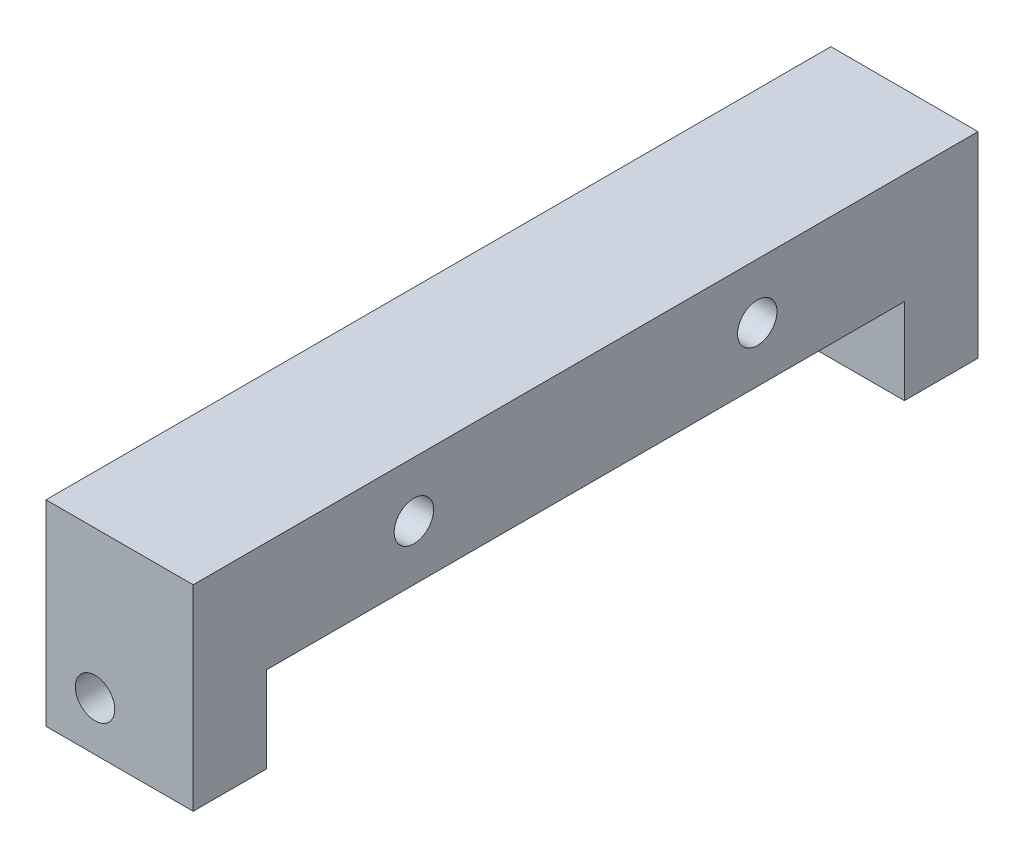
ISO-10303-21;
HEADER;
FILE_DESCRIPTION(('STEP AP214'),'2;1');
FILE_NAME('part.step','',(''),(''),'','','');
FILE_SCHEMA(('AUTOMOTIVE_DESIGN { 1 0 10303 214 1 1 1 1 }'));
ENDSEC;
DATA;
#1=APPLICATION_CONTEXT('core data for automotive mechanical design processes');
#2=APPLICATION_PROTOCOL_DEFINITION('international standard','automotive_design',2000,#1);
#3=PRODUCT_CONTEXT('',#1,'mechanical');
#4=PRODUCT('Part','Part','',(#3));
#5=PRODUCT_RELATED_PRODUCT_CATEGORY('part','',(#4));
#6=PRODUCT_DEFINITION_FORMATION('','',#4);
#7=PRODUCT_DEFINITION_CONTEXT('part definition',#1,'design');
#8=PRODUCT_DEFINITION('design','',#6,#7);
#9=PRODUCT_DEFINITION_SHAPE('','',#8);
#10=(LENGTH_UNIT() NAMED_UNIT(*) SI_UNIT(.MILLI.,.METRE.));
#11=(NAMED_UNIT(*) PLANE_ANGLE_UNIT() SI_UNIT($,.RADIAN.));
#12=(NAMED_UNIT(*) SI_UNIT($,.STERADIAN.) SOLID_ANGLE_UNIT());
#13=UNCERTAINTY_MEASURE_WITH_UNIT(LENGTH_MEASURE(1.E-05),#10,'distance_accuracy_value','');
#14=(GEOMETRIC_REPRESENTATION_CONTEXT(3) GLOBAL_UNCERTAINTY_ASSIGNED_CONTEXT((#13)) GLOBAL_UNIT_ASSIGNED_CONTEXT((#10,
#11,#12)) REPRESENTATION_CONTEXT('',''));
#15=CARTESIAN_POINT('',(0.,0.,0.));
#16=DIRECTION('',(0.,0.,1.));
#17=DIRECTION('',(1.,0.,0.));
#18=AXIS2_PLACEMENT_3D('',#15,#16,#17);
#19=CARTESIAN_POINT('',(-9.525,-12.7,50.8));
#20=DIRECTION('',(0.,1.,0.));
#21=DIRECTION('',(0.,0.,1.));
#22=AXIS2_PLACEMENT_3D('',#19,#20,#21);
#23=PLANE('',#22);
#24=CARTESIAN_POINT('',(4.7625,-12.7,46.0375));
#25=DIRECTION('',(0.,-1.,0.));
#26=DIRECTION('',(0.,0.,-1.));
#27=AXIS2_PLACEMENT_3D('',#24,#25,#26);
#28=CIRCLE('',#27,2.55269999999999);
#29=CARTESIAN_POINT('',(4.7625,-12.7,43.4848));
#30=VERTEX_POINT('',#29);
#31=EDGE_CURVE('E125',#30,#30,#28,.T.);
#32=ORIENTED_EDGE('',*,*,#31,.F.);
#33=EDGE_LOOP('',(#32));
#34=FACE_BOUND('',#33,.T.);
#35=DIRECTION('',(0.,0.,-1.));
#36=VECTOR('',#35,1.);
#37=CARTESIAN_POINT('',(-9.525,-12.7,50.8));
#38=LINE('',#37,#36);
#39=CARTESIAN_POINT('',(-9.525,-12.7,50.8));
#40=VERTEX_POINT('',#39);
#41=CARTESIAN_POINT('',(-9.525,-12.7,41.275));
#42=VERTEX_POINT('',#41);
#43=EDGE_CURVE('E11',#40,#42,#38,.T.);
#44=ORIENTED_EDGE('',*,*,#43,.T.);
#45=DIRECTION('',(1.,0.,0.));
#46=VECTOR('',#45,1.);
#47=CARTESIAN_POINT('',(-9.52600000000001,-12.7,41.275));
#48=LINE('',#47,#46);
#49=CARTESIAN_POINT('',(9.525,-12.7,41.275));
#50=VERTEX_POINT('',#49);
#51=EDGE_CURVE('E168',#42,#50,#48,.T.);
#52=ORIENTED_EDGE('',*,*,#51,.T.);
#53=DIRECTION('',(0.,0.,-1.));
#54=VECTOR('',#53,1.);
#55=CARTESIAN_POINT('',(9.525,-12.7,50.8));
#56=LINE('',#55,#54);
#57=CARTESIAN_POINT('',(9.525,-12.7,50.8));
#58=VERTEX_POINT('',#57);
#59=EDGE_CURVE('E195',#58,#50,#56,.T.);
#60=ORIENTED_EDGE('',*,*,#59,.F.);
#61=DIRECTION('',(1.,0.,0.));
#62=VECTOR('',#61,1.);
#63=CARTESIAN_POINT('',(-9.525,-12.7,50.8));
#64=LINE('',#63,#62);
#65=EDGE_CURVE('E88',#40,#58,#64,.T.);
#66=ORIENTED_EDGE('',*,*,#65,.F.);
#67=EDGE_LOOP('',(#44,#52,#60,#66));
#68=FACE_BOUND('',#67,.T.);
#69=ADVANCED_FACE('F36',(#34,#68),#23,.F.);
#70=CARTESIAN_POINT('',(-9.525,12.7,50.8));
#71=DIRECTION('',(1.,0.,0.));
#72=DIRECTION('',(0.,1.,0.));
#73=AXIS2_PLACEMENT_3D('',#70,#71,#72);
#74=PLANE('',#73);
#75=CARTESIAN_POINT('',(-9.525,5.56260000000001,-22.225));
#76=DIRECTION('',(-1.,0.,0.));
#77=DIRECTION('',(0.,0.,1.));
#78=AXIS2_PLACEMENT_3D('',#75,#76,#77);
#79=CIRCLE('',#78,2.55269999999999);
#80=CARTESIAN_POINT('',(-9.525,5.56260000000001,-19.6723));
#81=VERTEX_POINT('',#80);
#82=EDGE_CURVE('E285',#81,#81,#79,.T.);
#83=ORIENTED_EDGE('',*,*,#82,.F.);
#84=EDGE_LOOP('',(#83));
#85=FACE_BOUND('',#84,.T.);
#86=CARTESIAN_POINT('',(-9.525,5.5626,22.225));
#87=DIRECTION('',(-1.,0.,0.));
#88=DIRECTION('',(0.,0.,1.));
#89=AXIS2_PLACEMENT_3D('',#86,#87,#88);
#90=CIRCLE('',#89,2.55269999999999);
#91=CARTESIAN_POINT('',(-9.525,5.5626,24.7777));
#92=VERTEX_POINT('',#91);
#93=EDGE_CURVE('E132',#92,#92,#90,.T.);
#94=ORIENTED_EDGE('',*,*,#93,.F.);
#95=EDGE_LOOP('',(#94));
#96=FACE_BOUND('',#95,.T.);
#97=DIRECTION('',(0.,0.,-1.));
#98=VECTOR('',#97,1.);
#99=CARTESIAN_POINT('',(-9.525,-1.5875,41.275));
#100=LINE('',#99,#98);
#101=CARTESIAN_POINT('',(-9.525,-1.5875,41.275));
#102=VERTEX_POINT('',#101);
#103=CARTESIAN_POINT('',(-9.525,-1.5875,-41.275));
#104=VERTEX_POINT('',#103);
#105=EDGE_CURVE('E155',#102,#104,#100,.T.);
#106=ORIENTED_EDGE('',*,*,#105,.F.);
#107=DIRECTION('',(0.,1.,0.));
#108=VECTOR('',#107,1.);
#109=CARTESIAN_POINT('',(-9.525,-12.7,41.275));
#110=LINE('',#109,#108);
#111=EDGE_CURVE('E158',#42,#102,#110,.T.);
#112=ORIENTED_EDGE('',*,*,#111,.F.);
#113=ORIENTED_EDGE('',*,*,#43,.F.);
#114=DIRECTION('',(0.,-1.,0.));
#115=VECTOR('',#114,1.);
#116=CARTESIAN_POINT('',(-9.525,12.7,50.8));
#117=LINE('',#116,#115);
#118=CARTESIAN_POINT('',(-9.525,12.7,50.8));
#119=VERTEX_POINT('',#118);
#120=EDGE_CURVE('E177',#119,#40,#117,.T.);
#121=ORIENTED_EDGE('',*,*,#120,.F.);
#122=DIRECTION('',(0.,0.,-1.));
#123=VECTOR('',#122,1.);
#124=CARTESIAN_POINT('',(-9.525,12.7,50.8));
#125=LINE('',#124,#123);
#126=CARTESIAN_POINT('',(-9.525,12.7,-50.8));
#127=VERTEX_POINT('',#126);
#128=EDGE_CURVE('E183',#119,#127,#125,.T.);
#129=ORIENTED_EDGE('',*,*,#128,.T.);
#130=DIRECTION('',(0.,-1.,0.));
#131=VECTOR('',#130,1.);
#132=CARTESIAN_POINT('',(-9.525,12.7,-50.8));
#133=LINE('',#132,#131);
#134=CARTESIAN_POINT('',(-9.525,-12.7,-50.8));
#135=VERTEX_POINT('',#134);
#136=EDGE_CURVE('E171',#127,#135,#133,.T.);
#137=ORIENTED_EDGE('',*,*,#136,.T.);
#138=CARTESIAN_POINT('',(-9.525,-12.7,-41.275));
#139=VERTEX_POINT('',#138);
#140=EDGE_CURVE('E44',#139,#135,#38,.T.);
#141=ORIENTED_EDGE('',*,*,#140,.F.);
#142=DIRECTION('',(0.,-1.,0.));
#143=VECTOR('',#142,1.);
#144=CARTESIAN_POINT('',(-9.525,-12.7,-41.275));
#145=LINE('',#144,#143);
#146=EDGE_CURVE('E153',#104,#139,#145,.T.);
#147=ORIENTED_EDGE('',*,*,#146,.F.);
#148=EDGE_LOOP('',(#106,#112,#113,#121,#129,#137,#141,#147));
#149=FACE_BOUND('',#148,.T.);
#150=ADVANCED_FACE('F38',(#85,#96,#149),#74,.F.);
#151=CARTESIAN_POINT('',(4.7625,-12.7,-46.0375));
#152=DIRECTION('',(0.,-1.,0.));
#153=DIRECTION('',(0.,0.,-1.));
#154=AXIS2_PLACEMENT_3D('',#151,#152,#153);
#155=CIRCLE('',#154,2.55269999999999);
#156=CARTESIAN_POINT('',(4.7625,-12.7,-48.5902));
#157=VERTEX_POINT('',#156);
#158=EDGE_CURVE('E138',#157,#157,#155,.T.);
#159=ORIENTED_EDGE('',*,*,#158,.F.);
#160=EDGE_LOOP('',(#159));
#161=FACE_BOUND('',#160,.T.);
#162=CARTESIAN_POINT('',(9.525,-12.7,-41.275));
#163=VERTEX_POINT('',#162);
#164=CARTESIAN_POINT('',(9.525,-12.7,-50.8));
#165=VERTEX_POINT('',#164);
#166=EDGE_CURVE('E194',#163,#165,#56,.T.);
#167=ORIENTED_EDGE('',*,*,#166,.F.);
#168=DIRECTION('',(1.,0.,0.));
#169=VECTOR('',#168,1.);
#170=CARTESIAN_POINT('',(-9.52600000000001,-12.7,-41.275));
#171=LINE('',#170,#169);
#172=EDGE_CURVE('E51',#139,#163,#171,.T.);
#173=ORIENTED_EDGE('',*,*,#172,.F.);
#174=ORIENTED_EDGE('',*,*,#140,.T.);
#175=DIRECTION('',(1.,0.,0.));
#176=VECTOR('',#175,1.);
#177=CARTESIAN_POINT('',(-9.525,-12.7,-50.8));
#178=LINE('',#177,#176);
#179=EDGE_CURVE('E186',#135,#165,#178,.T.);
#180=ORIENTED_EDGE('',*,*,#179,.T.);
#181=EDGE_LOOP('',(#167,#173,#174,#180));
#182=FACE_BOUND('',#181,.T.);
#183=ADVANCED_FACE('F207',(#161,#182),#23,.F.);
#184=CARTESIAN_POINT('',(9.525,12.7,50.8));
#185=DIRECTION('',(-1.,0.,0.));
#186=DIRECTION('',(0.,-1.,0.));
#187=AXIS2_PLACEMENT_3D('',#184,#185,#186);
#188=PLANE('',#187);
#189=CARTESIAN_POINT('',(9.525,5.56260000000001,-22.225));
#190=DIRECTION('',(-1.,0.,0.));
#191=DIRECTION('',(0.,-1.,0.));
#192=AXIS2_PLACEMENT_3D('',#189,#190,#191);
#193=CIRCLE('',#192,2.55269999999999);
#194=CARTESIAN_POINT('',(9.525,3.00990000000002,-22.225));
#195=VERTEX_POINT('',#194);
#196=EDGE_CURVE('E282',#195,#195,#193,.T.);
#197=ORIENTED_EDGE('',*,*,#196,.T.);
#198=EDGE_LOOP('',(#197));
#199=FACE_BOUND('',#198,.T.);
#200=CARTESIAN_POINT('',(9.525,5.5626,22.225));
#201=DIRECTION('',(-1.,0.,0.));
#202=DIRECTION('',(0.,-1.,0.));
#203=AXIS2_PLACEMENT_3D('',#200,#201,#202);
#204=CIRCLE('',#203,2.55269999999999);
#205=CARTESIAN_POINT('',(9.525,3.00990000000001,22.225));
#206=VERTEX_POINT('',#205);
#207=EDGE_CURVE('E126',#206,#206,#204,.T.);
#208=ORIENTED_EDGE('',*,*,#207,.T.);
#209=EDGE_LOOP('',(#208));
#210=FACE_BOUND('',#209,.T.);
#211=ORIENTED_EDGE('',*,*,#59,.T.);
#212=DIRECTION('',(0.,-1.,0.));
#213=VECTOR('',#212,1.);
#214=CARTESIAN_POINT('',(9.525,-12.7,41.275));
#215=LINE('',#214,#213);
#216=CARTESIAN_POINT('',(9.525,-1.5875,41.275));
#217=VERTEX_POINT('',#216);
#218=EDGE_CURVE('E161',#217,#50,#215,.T.);
#219=ORIENTED_EDGE('',*,*,#218,.F.);
#220=DIRECTION('',(0.,0.,1.));
#221=VECTOR('',#220,1.);
#222=CARTESIAN_POINT('',(9.525,-1.5875,41.275));
#223=LINE('',#222,#221);
#224=CARTESIAN_POINT('',(9.525,-1.5875,-41.275));
#225=VERTEX_POINT('',#224);
#226=EDGE_CURVE('E165',#225,#217,#223,.T.);
#227=ORIENTED_EDGE('',*,*,#226,.F.);
#228=DIRECTION('',(0.,1.,0.));
#229=VECTOR('',#228,1.);
#230=CARTESIAN_POINT('',(9.525,-12.7,-41.275));
#231=LINE('',#230,#229);
#232=EDGE_CURVE('E163',#163,#225,#231,.T.);
#233=ORIENTED_EDGE('',*,*,#232,.F.);
#234=ORIENTED_EDGE('',*,*,#166,.T.);
#235=DIRECTION('',(0.,1.,0.));
#236=VECTOR('',#235,1.);
#237=CARTESIAN_POINT('',(9.525,12.7,-50.8));
#238=LINE('',#237,#236);
#239=CARTESIAN_POINT('',(9.525,12.7,-50.8));
#240=VERTEX_POINT('',#239);
#241=EDGE_CURVE('E189',#165,#240,#238,.T.);
#242=ORIENTED_EDGE('',*,*,#241,.T.);
#243=DIRECTION('',(0.,0.,-1.));
#244=VECTOR('',#243,1.);
#245=CARTESIAN_POINT('',(9.525,12.7,50.8));
#246=LINE('',#245,#244);
#247=CARTESIAN_POINT('',(9.525,12.7,50.8));
#248=VERTEX_POINT('',#247);
#249=EDGE_CURVE('E193',#248,#240,#246,.T.);
#250=ORIENTED_EDGE('',*,*,#249,.F.);
#251=DIRECTION('',(0.,1.,0.));
#252=VECTOR('',#251,1.);
#253=CARTESIAN_POINT('',(9.525,12.7,50.8));
#254=LINE('',#253,#252);
#255=EDGE_CURVE('E180',#58,#248,#254,.T.);
#256=ORIENTED_EDGE('',*,*,#255,.F.);
#257=EDGE_LOOP('',(#211,#219,#227,#233,#234,#242,#250,#256));
#258=FACE_BOUND('',#257,.T.);
#259=ADVANCED_FACE('F201',(#199,#210,#258),#188,.F.);
#260=CARTESIAN_POINT('',(-9.525,12.7,50.8));
#261=DIRECTION('',(0.,-1.,0.));
#262=DIRECTION('',(0.,0.,-1.));
#263=AXIS2_PLACEMENT_3D('',#260,#261,#262);
#264=PLANE('',#263);
#265=DIRECTION('',(-1.,0.,0.));
#266=VECTOR('',#265,1.);
#267=CARTESIAN_POINT('',(-9.525,12.7,-50.8));
#268=LINE('',#267,#266);
#269=EDGE_CURVE('E81',#240,#127,#268,.T.);
#270=ORIENTED_EDGE('',*,*,#269,.T.);
#271=ORIENTED_EDGE('',*,*,#128,.F.);
#272=DIRECTION('',(-1.,0.,0.));
#273=VECTOR('',#272,1.);
#274=CARTESIAN_POINT('',(-9.525,12.7,50.8));
#275=LINE('',#274,#273);
#276=EDGE_CURVE('E60',#248,#119,#275,.T.);
#277=ORIENTED_EDGE('',*,*,#276,.F.);
#278=ORIENTED_EDGE('',*,*,#249,.T.);
#279=EDGE_LOOP('',(#270,#271,#277,#278));
#280=FACE_BOUND('',#279,.T.);
#281=ADVANCED_FACE('F217',(#280),#264,.F.);
#282=CARTESIAN_POINT('',(-9.525,-12.7,50.8));
#283=DIRECTION('',(0.,0.,1.));
#284=DIRECTION('',(1.,0.,0.));
#285=AXIS2_PLACEMENT_3D('',#282,#283,#284);
#286=PLANE('',#285);
#287=CARTESIAN_POINT('',(-3.175,-6.35,50.8));
#288=DIRECTION('',(0.,0.,1.));
#289=DIRECTION('',(1.,0.,0.));
#290=AXIS2_PLACEMENT_3D('',#287,#288,#289);
#291=CIRCLE('',#290,2.55269999999999);
#292=CARTESIAN_POINT('',(-0.622300000000017,-6.35,50.8));
#293=VERTEX_POINT('',#292);
#294=EDGE_CURVE('E141',#293,#293,#291,.T.);
#295=ORIENTED_EDGE('',*,*,#294,.F.);
#296=EDGE_LOOP('',(#295));
#297=FACE_BOUND('',#296,.T.);
#298=ORIENTED_EDGE('',*,*,#120,.T.);
#299=ORIENTED_EDGE('',*,*,#65,.T.);
#300=ORIENTED_EDGE('',*,*,#255,.T.);
#301=ORIENTED_EDGE('',*,*,#276,.T.);
#302=EDGE_LOOP('',(#298,#299,#300,#301));
#303=FACE_BOUND('',#302,.T.);
#304=ADVANCED_FACE('F218',(#297,#303),#286,.T.);
#305=CARTESIAN_POINT('',(-9.525,-12.7,-50.8));
#306=DIRECTION('',(0.,0.,1.));
#307=DIRECTION('',(1.,0.,0.));
#308=AXIS2_PLACEMENT_3D('',#305,#306,#307);
#309=PLANE('',#308);
#310=CARTESIAN_POINT('',(-3.175,-6.35,-50.8));
#311=DIRECTION('',(0.,0.,-1.));
#312=DIRECTION('',(-1.,0.,0.));
#313=AXIS2_PLACEMENT_3D('',#310,#311,#312);
#314=CIRCLE('',#313,2.55269999999999);
#315=CARTESIAN_POINT('',(-5.72769999999999,-6.35,-50.8));
#316=VERTEX_POINT('',#315);
#317=EDGE_CURVE('E147',#316,#316,#314,.T.);
#318=ORIENTED_EDGE('',*,*,#317,.F.);
#319=EDGE_LOOP('',(#318));
#320=FACE_BOUND('',#319,.T.);
#321=ORIENTED_EDGE('',*,*,#136,.F.);
#322=ORIENTED_EDGE('',*,*,#269,.F.);
#323=ORIENTED_EDGE('',*,*,#241,.F.);
#324=ORIENTED_EDGE('',*,*,#179,.F.);
#325=EDGE_LOOP('',(#321,#322,#323,#324));
#326=FACE_BOUND('',#325,.T.);
#327=ADVANCED_FACE('F211',(#320,#326),#309,.F.);
#328=CARTESIAN_POINT('',(-9.52600000000001,-12.7,41.275));
#329=DIRECTION('',(0.,0.,1.));
#330=DIRECTION('',(1.,0.,0.));
#331=AXIS2_PLACEMENT_3D('',#328,#329,#330);
#332=PLANE('',#331);
#333=CARTESIAN_POINT('',(-3.175,-6.35,41.275));
#334=DIRECTION('',(0.,0.,1.));
#335=DIRECTION('',(1.,0.,0.));
#336=AXIS2_PLACEMENT_3D('',#333,#334,#335);
#337=CIRCLE('',#336,2.55269999999999);
#338=CARTESIAN_POINT('',(-0.622300000000011,-6.35,41.275));
#339=VERTEX_POINT('',#338);
#340=EDGE_CURVE('E144',#339,#339,#337,.T.);
#341=ORIENTED_EDGE('',*,*,#340,.T.);
#342=EDGE_LOOP('',(#341));
#343=FACE_BOUND('',#342,.T.);
#344=ORIENTED_EDGE('',*,*,#111,.T.);
#345=DIRECTION('',(1.,0.,0.));
#346=VECTOR('',#345,1.);
#347=CARTESIAN_POINT('',(-9.52600000000001,-1.5875,41.275));
#348=LINE('',#347,#346);
#349=EDGE_CURVE('E169',#102,#217,#348,.T.);
#350=ORIENTED_EDGE('',*,*,#349,.T.);
#351=ORIENTED_EDGE('',*,*,#218,.T.);
#352=ORIENTED_EDGE('',*,*,#51,.F.);
#353=EDGE_LOOP('',(#344,#350,#351,#352));
#354=FACE_BOUND('',#353,.T.);
#355=ADVANCED_FACE('F221',(#343,#354),#332,.F.);
#356=CARTESIAN_POINT('',(-9.52600000000001,-1.5875,41.275));
#357=DIRECTION('',(0.,1.,0.));
#358=DIRECTION('',(-1.,0.,0.));
#359=AXIS2_PLACEMENT_3D('',#356,#357,#358);
#360=PLANE('',#359);
#361=ORIENTED_EDGE('',*,*,#105,.T.);
#362=DIRECTION('',(1.,0.,0.));
#363=VECTOR('',#362,1.);
#364=CARTESIAN_POINT('',(-9.52600000000001,-1.5875,-41.275));
#365=LINE('',#364,#363);
#366=EDGE_CURVE('E172',#104,#225,#365,.T.);
#367=ORIENTED_EDGE('',*,*,#366,.T.);
#368=ORIENTED_EDGE('',*,*,#226,.T.);
#369=ORIENTED_EDGE('',*,*,#349,.F.);
#370=EDGE_LOOP('',(#361,#367,#368,#369));
#371=FACE_BOUND('',#370,.T.);
#372=ADVANCED_FACE('F223',(#371),#360,.F.);
#373=CARTESIAN_POINT('',(-9.52600000000001,-12.7,-41.275));
#374=DIRECTION('',(0.,0.,-1.));
#375=DIRECTION('',(0.,1.,0.));
#376=AXIS2_PLACEMENT_3D('',#373,#374,#375);
#377=PLANE('',#376);
#378=CARTESIAN_POINT('',(-3.175,-6.35,-41.275));
#379=DIRECTION('',(0.,0.,-1.));
#380=DIRECTION('',(0.,1.,0.));
#381=AXIS2_PLACEMENT_3D('',#378,#379,#380);
#382=CIRCLE('',#381,2.55269999999999);
#383=CARTESIAN_POINT('',(-3.175,-3.79730000000001,-41.275));
#384=VERTEX_POINT('',#383);
#385=EDGE_CURVE('E150',#384,#384,#382,.T.);
#386=ORIENTED_EDGE('',*,*,#385,.T.);
#387=EDGE_LOOP('',(#386));
#388=FACE_BOUND('',#387,.T.);
#389=ORIENTED_EDGE('',*,*,#146,.T.);
#390=ORIENTED_EDGE('',*,*,#172,.T.);
#391=ORIENTED_EDGE('',*,*,#232,.T.);
#392=ORIENTED_EDGE('',*,*,#366,.F.);
#393=EDGE_LOOP('',(#389,#390,#391,#392));
#394=FACE_BOUND('',#393,.T.);
#395=ADVANCED_FACE('F224',(#388,#394),#377,.F.);
#396=CARTESIAN_POINT('',(-3.175,-6.35,-50.8));
#397=DIRECTION('',(0.,0.,-1.));
#398=DIRECTION('',(-1.,0.,0.));
#399=AXIS2_PLACEMENT_3D('',#396,#397,#398);
#400=CYLINDRICAL_SURFACE('',#399,2.55269999999999);
#401=ORIENTED_EDGE('',*,*,#385,.F.);
#402=EDGE_LOOP('',(#401));
#403=FACE_BOUND('',#402,.T.);
#404=ORIENTED_EDGE('',*,*,#317,.T.);
#405=EDGE_LOOP('',(#404));
#406=FACE_BOUND('',#405,.T.);
#407=ADVANCED_FACE('F226',(#403,#406),#400,.F.);
#408=CARTESIAN_POINT('',(-3.175,-6.35,50.8));
#409=DIRECTION('',(0.,0.,1.));
#410=DIRECTION('',(1.,0.,0.));
#411=AXIS2_PLACEMENT_3D('',#408,#409,#410);
#412=CYLINDRICAL_SURFACE('',#411,2.55269999999999);
#413=ORIENTED_EDGE('',*,*,#340,.F.);
#414=EDGE_LOOP('',(#413));
#415=FACE_BOUND('',#414,.T.);
#416=ORIENTED_EDGE('',*,*,#294,.T.);
#417=EDGE_LOOP('',(#416));
#418=FACE_BOUND('',#417,.T.);
#419=ADVANCED_FACE('F233',(#415,#418),#412,.F.);
#420=CARTESIAN_POINT('',(4.7625,-12.7,-46.0375));
#421=DIRECTION('',(0.,-1.,0.));
#422=DIRECTION('',(0.,0.,-1.));
#423=AXIS2_PLACEMENT_3D('',#420,#421,#422);
#424=CYLINDRICAL_SURFACE('',#423,2.55269999999999);
#425=CARTESIAN_POINT('',(4.7625,3.81,-46.0375));
#426=DIRECTION('',(0.,-1.,0.));
#427=DIRECTION('',(0.,0.,-1.));
#428=AXIS2_PLACEMENT_3D('',#425,#426,#427);
#429=CIRCLE('',#428,2.55269999999999);
#430=CARTESIAN_POINT('',(4.7625,3.81,-48.5902));
#431=VERTEX_POINT('',#430);
#432=EDGE_CURVE('E129',#431,#431,#429,.T.);
#433=ORIENTED_EDGE('',*,*,#432,.F.);
#434=EDGE_LOOP('',(#433));
#435=FACE_BOUND('',#434,.T.);
#436=ORIENTED_EDGE('',*,*,#158,.T.);
#437=EDGE_LOOP('',(#436));
#438=FACE_BOUND('',#437,.T.);
#439=ADVANCED_FACE('F254',(#435,#438),#424,.F.);
#440=CARTESIAN_POINT('',(4.7625,3.81,-46.0375));
#441=DIRECTION('',(0.,-1.,0.));
#442=DIRECTION('',(0.,0.,-1.));
#443=AXIS2_PLACEMENT_3D('',#440,#441,#442);
#444=CONICAL_SURFACE('',#443,2.55269999999999,1.02974425867665);
#445=CARTESIAN_POINT('',(4.7625,5.34381690219165,-46.0375));
#446=VERTEX_POINT('',#445);
#447=VERTEX_LOOP('',#446);
#448=FACE_BOUND('',#447,.T.);
#449=ORIENTED_EDGE('',*,*,#432,.T.);
#450=EDGE_LOOP('',(#449));
#451=FACE_BOUND('',#450,.T.);
#452=ADVANCED_FACE('F256',(#448,#451),#444,.F.);
#453=CARTESIAN_POINT('',(4.7625,-12.7,46.0375));
#454=DIRECTION('',(0.,-1.,0.));
#455=DIRECTION('',(0.,0.,-1.));
#456=AXIS2_PLACEMENT_3D('',#453,#454,#455);
#457=CYLINDRICAL_SURFACE('',#456,2.55269999999999);
#458=CARTESIAN_POINT('',(4.7625,3.81,46.0375));
#459=DIRECTION('',(0.,-1.,0.));
#460=DIRECTION('',(0.,0.,-1.));
#461=AXIS2_PLACEMENT_3D('',#458,#459,#460);
#462=CIRCLE('',#461,2.55269999999999);
#463=CARTESIAN_POINT('',(4.7625,3.81,43.4848));
#464=VERTEX_POINT('',#463);
#465=EDGE_CURVE('E123',#464,#464,#462,.T.);
#466=ORIENTED_EDGE('',*,*,#465,.F.);
#467=EDGE_LOOP('',(#466));
#468=FACE_BOUND('',#467,.T.);
#469=ORIENTED_EDGE('',*,*,#31,.T.);
#470=EDGE_LOOP('',(#469));
#471=FACE_BOUND('',#470,.T.);
#472=ADVANCED_FACE('F119',(#468,#471),#457,.F.);
#473=CARTESIAN_POINT('',(4.7625,3.81,46.0375));
#474=DIRECTION('',(0.,-1.,0.));
#475=DIRECTION('',(0.,0.,-1.));
#476=AXIS2_PLACEMENT_3D('',#473,#474,#475);
#477=CONICAL_SURFACE('',#476,2.55269999999999,1.02974425867665);
#478=CARTESIAN_POINT('',(4.7625,5.34381690219165,46.0375));
#479=VERTEX_POINT('',#478);
#480=VERTEX_LOOP('',#479);
#481=FACE_BOUND('',#480,.T.);
#482=ORIENTED_EDGE('',*,*,#465,.T.);
#483=EDGE_LOOP('',(#482));
#484=FACE_BOUND('',#483,.T.);
#485=ADVANCED_FACE('F115',(#481,#484),#477,.F.);
#486=CARTESIAN_POINT('',(-9.525,5.5626,22.225));
#487=DIRECTION('',(-1.,0.,0.));
#488=DIRECTION('',(0.,0.,1.));
#489=AXIS2_PLACEMENT_3D('',#486,#487,#488);
#490=CYLINDRICAL_SURFACE('',#489,2.55269999999999);
#491=ORIENTED_EDGE('',*,*,#207,.F.);
#492=EDGE_LOOP('',(#491));
#493=FACE_BOUND('',#492,.T.);
#494=ORIENTED_EDGE('',*,*,#93,.T.);
#495=EDGE_LOOP('',(#494));
#496=FACE_BOUND('',#495,.T.);
#497=ADVANCED_FACE('F118',(#493,#496),#490,.F.);
#498=CARTESIAN_POINT('',(-9.525,5.56260000000001,-22.225));
#499=DIRECTION('',(-1.,0.,0.));
#500=DIRECTION('',(0.,0.,1.));
#501=AXIS2_PLACEMENT_3D('',#498,#499,#500);
#502=CYLINDRICAL_SURFACE('',#501,2.55269999999999);
#503=ORIENTED_EDGE('',*,*,#196,.F.);
#504=EDGE_LOOP('',(#503));
#505=FACE_BOUND('',#504,.T.);
#506=ORIENTED_EDGE('',*,*,#82,.T.);
#507=EDGE_LOOP('',(#506));
#508=FACE_BOUND('',#507,.T.);
#509=ADVANCED_FACE('F273',(#505,#508),#502,.F.);
#510=CLOSED_SHELL('',(#69,#150,#183,#259,#281,#304,#327,#355,#372,#395,#407,#419,#439,#452,#472,
#485,#497,#509));
#511=MANIFOLD_SOLID_BREP('B2',#510);
#512=ADVANCED_BREP_SHAPE_REPRESENTATION('',(#18,#511),#14);
#513=SHAPE_DEFINITION_REPRESENTATION(#9,#512);
ENDSEC;
END-ISO-10303-21;
